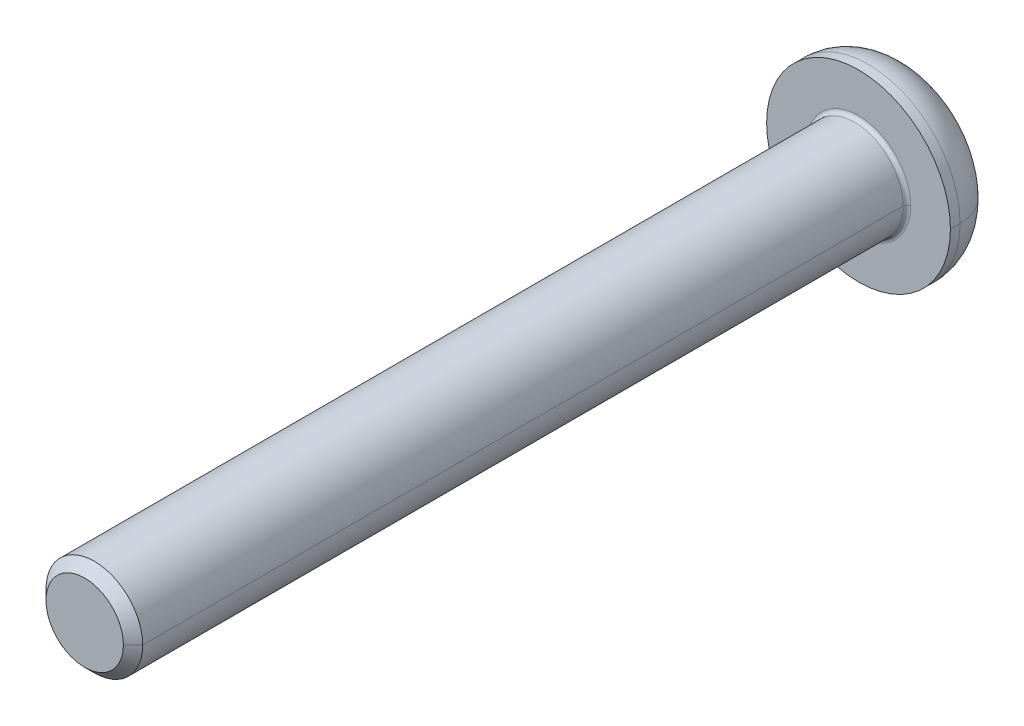
ISO-10303-21;
HEADER;
FILE_DESCRIPTION(('STEP AP214'),'2;1');
FILE_NAME('part.step','',(''),(''),'','','');
FILE_SCHEMA(('AUTOMOTIVE_DESIGN { 1 0 10303 214 1 1 1 1 }'));
ENDSEC;
DATA;
#1=APPLICATION_CONTEXT('core data for automotive mechanical design processes');
#2=APPLICATION_PROTOCOL_DEFINITION('international standard','automotive_design',2000,#1);
#3=PRODUCT_CONTEXT('',#1,'mechanical');
#4=PRODUCT('Part','Part','',(#3));
#5=PRODUCT_RELATED_PRODUCT_CATEGORY('part','',(#4));
#6=PRODUCT_DEFINITION_FORMATION('','',#4);
#7=PRODUCT_DEFINITION_CONTEXT('part definition',#1,'design');
#8=PRODUCT_DEFINITION('design','',#6,#7);
#9=PRODUCT_DEFINITION_SHAPE('','',#8);
#10=(LENGTH_UNIT() NAMED_UNIT(*) SI_UNIT(.MILLI.,.METRE.));
#11=(NAMED_UNIT(*) PLANE_ANGLE_UNIT() SI_UNIT($,.RADIAN.));
#12=(NAMED_UNIT(*) SI_UNIT($,.STERADIAN.) SOLID_ANGLE_UNIT());
#13=UNCERTAINTY_MEASURE_WITH_UNIT(LENGTH_MEASURE(1.E-05),#10,'distance_accuracy_value','');
#14=(GEOMETRIC_REPRESENTATION_CONTEXT(3) GLOBAL_UNCERTAINTY_ASSIGNED_CONTEXT((#13)) GLOBAL_UNIT_ASSIGNED_CONTEXT((#10,
#11,#12)) REPRESENTATION_CONTEXT('',''));
#15=CARTESIAN_POINT('',(0.,0.,0.));
#16=DIRECTION('',(0.,0.,1.));
#17=DIRECTION('',(1.,0.,0.));
#18=AXIS2_PLACEMENT_3D('',#15,#16,#17);
#19=CARTESIAN_POINT('',(0.,0.,0.2));
#20=DIRECTION('',(0.,0.,-1.));
#21=DIRECTION('',(-1.,0.,0.));
#22=AXIS2_PLACEMENT_3D('',#19,#20,#21);
#23=TOROIDAL_SURFACE('',#22,2.7,0.2);
#24=CARTESIAN_POINT('',(2.7,0.,0.2));
#25=DIRECTION('',(0.,1.,0.));
#26=DIRECTION('',(-1.,0.,0.));
#27=AXIS2_PLACEMENT_3D('',#24,#25,#26);
#28=CIRCLE('',#27,0.2);
#29=CARTESIAN_POINT('',(2.7,0.,0.));
#30=VERTEX_POINT('',#29);
#31=CARTESIAN_POINT('',(2.5,0.,0.2));
#32=VERTEX_POINT('',#31);
#33=EDGE_CURVE('E188',#30,#32,#28,.T.);
#34=ORIENTED_EDGE('',*,*,#33,.F.);
#35=CARTESIAN_POINT('',(0.,0.,0.));
#36=DIRECTION('',(0.,0.,-1.));
#37=DIRECTION('',(-1.,0.,0.));
#38=AXIS2_PLACEMENT_3D('',#35,#36,#37);
#39=CIRCLE('',#38,2.7);
#40=CARTESIAN_POINT('',(-2.7,0.,0.));
#41=VERTEX_POINT('',#40);
#42=EDGE_CURVE('E243',#41,#30,#39,.T.);
#43=ORIENTED_EDGE('',*,*,#42,.F.);
#44=CARTESIAN_POINT('',(-2.7,0.,0.2));
#45=DIRECTION('',(0.,-1.,0.));
#46=DIRECTION('',(0.,0.,-1.));
#47=AXIS2_PLACEMENT_3D('',#44,#45,#46);
#48=CIRCLE('',#47,0.2);
#49=CARTESIAN_POINT('',(-2.5,0.,0.2));
#50=VERTEX_POINT('',#49);
#51=EDGE_CURVE('E201',#41,#50,#48,.T.);
#52=ORIENTED_EDGE('',*,*,#51,.T.);
#53=CARTESIAN_POINT('',(0.,0.,0.2));
#54=DIRECTION('',(0.,0.,1.));
#55=DIRECTION('',(-1.,0.,0.));
#56=AXIS2_PLACEMENT_3D('',#53,#54,#55);
#57=CIRCLE('',#56,2.5);
#58=EDGE_CURVE('E197',#32,#50,#57,.T.);
#59=ORIENTED_EDGE('',*,*,#58,.F.);
#60=EDGE_LOOP('',(#34,#43,#52,#59));
#61=FACE_BOUND('',#60,.T.);
#62=ADVANCED_FACE('F18',(#61),#23,.F.);
#63=CARTESIAN_POINT('',(0.,0.,40.));
#64=DIRECTION('',(0.,0.,-1.));
#65=DIRECTION('',(-1.,0.,0.));
#66=AXIS2_PLACEMENT_3D('',#63,#64,#65);
#67=CONICAL_SURFACE('',#66,2.,0.785398163397446);
#68=DIRECTION('',(0.707106781186546,0.,-0.707106781186549));
#69=VECTOR('',#68,1.);
#70=CARTESIAN_POINT('',(2.,0.,40.));
#71=LINE('',#70,#69);
#72=CARTESIAN_POINT('',(2.,0.,40.));
#73=VERTEX_POINT('',#72);
#74=CARTESIAN_POINT('',(2.5,0.,39.5));
#75=VERTEX_POINT('',#74);
#76=EDGE_CURVE('E209',#73,#75,#71,.T.);
#77=ORIENTED_EDGE('',*,*,#76,.F.);
#78=CARTESIAN_POINT('',(0.,0.,40.));
#79=DIRECTION('',(0.,0.,1.));
#80=DIRECTION('',(1.,0.,0.));
#81=AXIS2_PLACEMENT_3D('',#78,#79,#80);
#82=CIRCLE('',#81,2.);
#83=CARTESIAN_POINT('',(-2.,0.,40.));
#84=VERTEX_POINT('',#83);
#85=EDGE_CURVE('E242',#84,#73,#82,.T.);
#86=ORIENTED_EDGE('',*,*,#85,.F.);
#87=DIRECTION('',(-0.707106781186546,0.,-0.707106781186549));
#88=VECTOR('',#87,1.);
#89=CARTESIAN_POINT('',(-2.,0.,40.));
#90=LINE('',#89,#88);
#91=CARTESIAN_POINT('',(-2.5,0.,39.5));
#92=VERTEX_POINT('',#91);
#93=EDGE_CURVE('E217',#84,#92,#90,.T.);
#94=ORIENTED_EDGE('',*,*,#93,.T.);
#95=CARTESIAN_POINT('',(0.,0.,39.5));
#96=DIRECTION('',(0.,0.,-1.));
#97=DIRECTION('',(1.,0.,0.));
#98=AXIS2_PLACEMENT_3D('',#95,#96,#97);
#99=CIRCLE('',#98,2.5);
#100=EDGE_CURVE('E239',#75,#92,#99,.T.);
#101=ORIENTED_EDGE('',*,*,#100,.F.);
#102=EDGE_LOOP('',(#77,#86,#94,#101));
#103=FACE_BOUND('',#102,.T.);
#104=ADVANCED_FACE('F345',(#103),#67,.T.);
#105=CARTESIAN_POINT('',(0.,0.,-0.5));
#106=DIRECTION('',(0.,0.,-1.));
#107=DIRECTION('',(-1.,0.,0.));
#108=AXIS2_PLACEMENT_3D('',#105,#106,#107);
#109=TOROIDAL_SURFACE('',#108,2.5,2.25);
#110=CARTESIAN_POINT('',(2.5,0.,-0.5));
#111=DIRECTION('',(0.,1.,0.));
#112=DIRECTION('',(-1.,0.,0.));
#113=AXIS2_PLACEMENT_3D('',#110,#111,#112);
#114=CIRCLE('',#113,2.25);
#115=CARTESIAN_POINT('',(4.75,0.,-0.5));
#116=VERTEX_POINT('',#115);
#117=CARTESIAN_POINT('',(2.5,0.,-2.75));
#118=VERTEX_POINT('',#117);
#119=EDGE_CURVE('E183',#116,#118,#114,.T.);
#120=ORIENTED_EDGE('',*,*,#119,.F.);
#121=CARTESIAN_POINT('',(0.,0.,-0.5));
#122=DIRECTION('',(0.,0.,1.));
#123=DIRECTION('',(-1.,0.,0.));
#124=AXIS2_PLACEMENT_3D('',#121,#122,#123);
#125=CIRCLE('',#124,4.75);
#126=CARTESIAN_POINT('',(-4.75,0.,-0.5));
#127=VERTEX_POINT('',#126);
#128=EDGE_CURVE('E158',#127,#116,#125,.T.);
#129=ORIENTED_EDGE('',*,*,#128,.F.);
#130=CARTESIAN_POINT('',(-2.5,0.,-0.5));
#131=DIRECTION('',(0.,-1.,0.));
#132=DIRECTION('',(0.,0.,-1.));
#133=AXIS2_PLACEMENT_3D('',#130,#131,#132);
#134=CIRCLE('',#133,2.25);
#135=CARTESIAN_POINT('',(-2.5,0.,-2.75));
#136=VERTEX_POINT('',#135);
#137=EDGE_CURVE('E170',#127,#136,#134,.T.);
#138=ORIENTED_EDGE('',*,*,#137,.T.);
#139=CARTESIAN_POINT('',(0.,0.,-2.75));
#140=DIRECTION('',(0.,0.,-1.));
#141=DIRECTION('',(-1.,0.,0.));
#142=AXIS2_PLACEMENT_3D('',#139,#140,#141);
#143=CIRCLE('',#142,2.5);
#144=EDGE_CURVE('E157',#118,#136,#143,.T.);
#145=ORIENTED_EDGE('',*,*,#144,.F.);
#146=EDGE_LOOP('',(#120,#129,#138,#145));
#147=FACE_BOUND('',#146,.T.);
#148=ADVANCED_FACE('F350',(#147),#109,.T.);
#149=CARTESIAN_POINT('',(0.,0.,-1.19));
#150=DIRECTION('',(0.,0.,-1.));
#151=DIRECTION('',(0.,-1.,0.));
#152=AXIS2_PLACEMENT_3D('',#149,#150,#151);
#153=PLANE('',#152);
#154=DIRECTION('',(-1.,0.,0.));
#155=VECTOR('',#154,1.);
#156=CARTESIAN_POINT('',(0.866025403784439,-1.5,-1.19));
#157=LINE('',#156,#155);
#158=CARTESIAN_POINT('',(0.866025403784439,-1.5,-1.19));
#159=VERTEX_POINT('',#158);
#160=CARTESIAN_POINT('',(-0.866025403784439,-1.5,-1.19));
#161=VERTEX_POINT('',#160);
#162=EDGE_CURVE('E279',#159,#161,#157,.T.);
#163=ORIENTED_EDGE('',*,*,#162,.T.);
#164=DIRECTION('',(-0.5,0.866025403784439,0.));
#165=VECTOR('',#164,1.);
#166=CARTESIAN_POINT('',(-0.866025403784439,-1.5,-1.19));
#167=LINE('',#166,#165);
#168=CARTESIAN_POINT('',(-1.73205080756888,0.,-1.19));
#169=VERTEX_POINT('',#168);
#170=EDGE_CURVE('E11',#161,#169,#167,.T.);
#171=ORIENTED_EDGE('',*,*,#170,.T.);
#172=DIRECTION('',(0.5,0.866025403784439,0.));
#173=VECTOR('',#172,1.);
#174=CARTESIAN_POINT('',(-1.73205080756888,0.,-1.19));
#175=LINE('',#174,#173);
#176=CARTESIAN_POINT('',(-0.86602540378444,1.5,-1.19));
#177=VERTEX_POINT('',#176);
#178=EDGE_CURVE('E46',#169,#177,#175,.T.);
#179=ORIENTED_EDGE('',*,*,#178,.T.);
#180=DIRECTION('',(1.,0.,0.));
#181=VECTOR('',#180,1.);
#182=CARTESIAN_POINT('',(-0.86602540378444,1.5,-1.19));
#183=LINE('',#182,#181);
#184=CARTESIAN_POINT('',(0.866025403784439,1.5,-1.19));
#185=VERTEX_POINT('',#184);
#186=EDGE_CURVE('E292',#177,#185,#183,.T.);
#187=ORIENTED_EDGE('',*,*,#186,.T.);
#188=DIRECTION('',(0.5,-0.866025403784439,0.));
#189=VECTOR('',#188,1.);
#190=CARTESIAN_POINT('',(0.866025403784439,1.5,-1.19));
#191=LINE('',#190,#189);
#192=CARTESIAN_POINT('',(1.73205080756888,0.,-1.19));
#193=VERTEX_POINT('',#192);
#194=EDGE_CURVE('E226',#185,#193,#191,.T.);
#195=ORIENTED_EDGE('',*,*,#194,.T.);
#196=DIRECTION('',(-0.5,-0.866025403784439,0.));
#197=VECTOR('',#196,1.);
#198=CARTESIAN_POINT('',(1.73205080756888,0.,-1.19));
#199=LINE('',#198,#197);
#200=EDGE_CURVE('E285',#193,#159,#199,.T.);
#201=ORIENTED_EDGE('',*,*,#200,.T.);
#202=EDGE_LOOP('',(#163,#171,#179,#187,#195,#201));
#203=FACE_BOUND('',#202,.T.);
#204=ADVANCED_FACE('F322',(#203),#153,.T.);
#205=CARTESIAN_POINT('',(-0.866025403784439,-1.5,-1.19));
#206=DIRECTION('',(-0.866025403784439,-0.5,0.));
#207=DIRECTION('',(-0.5,0.866025403784439,0.));
#208=AXIS2_PLACEMENT_3D('',#205,#206,#207);
#209=PLANE('',#208);
#210=DIRECTION('',(-0.5,0.866025403784439,0.));
#211=VECTOR('',#210,1.);
#212=CARTESIAN_POINT('',(-0.866025403784439,-1.5,-2.75));
#213=LINE('',#212,#211);
#214=CARTESIAN_POINT('',(-0.866025403784439,-1.5,-2.75));
#215=VERTEX_POINT('',#214);
#216=CARTESIAN_POINT('',(-1.73205080756888,0.,-2.75));
#217=VERTEX_POINT('',#216);
#218=EDGE_CURVE('E247',#215,#217,#213,.T.);
#219=ORIENTED_EDGE('',*,*,#218,.T.);
#220=DIRECTION('',(0.,0.,-1.));
#221=VECTOR('',#220,1.);
#222=CARTESIAN_POINT('',(-1.73205080756888,0.,-1.19));
#223=LINE('',#222,#221);
#224=EDGE_CURVE('E21',#169,#217,#223,.T.);
#225=ORIENTED_EDGE('',*,*,#224,.F.);
#226=ORIENTED_EDGE('',*,*,#170,.F.);
#227=DIRECTION('',(0.,0.,-1.));
#228=VECTOR('',#227,1.);
#229=CARTESIAN_POINT('',(-0.866025403784439,-1.5,-1.19));
#230=LINE('',#229,#228);
#231=EDGE_CURVE('E246',#161,#215,#230,.T.);
#232=ORIENTED_EDGE('',*,*,#231,.T.);
#233=EDGE_LOOP('',(#219,#225,#226,#232));
#234=FACE_BOUND('',#233,.T.);
#235=ADVANCED_FACE('F309',(#234),#209,.F.);
#236=CARTESIAN_POINT('',(-1.73205080756888,0.,-1.19));
#237=DIRECTION('',(-0.866025403784439,0.5,0.));
#238=DIRECTION('',(0.,0.,1.));
#239=AXIS2_PLACEMENT_3D('',#236,#237,#238);
#240=PLANE('',#239);
#241=DIRECTION('',(0.5,0.866025403784439,0.));
#242=VECTOR('',#241,1.);
#243=CARTESIAN_POINT('',(-1.73205080756888,0.,-2.75));
#244=LINE('',#243,#242);
#245=CARTESIAN_POINT('',(-0.86602540378444,1.5,-2.75));
#246=VERTEX_POINT('',#245);
#247=EDGE_CURVE('E270',#217,#246,#244,.T.);
#248=ORIENTED_EDGE('',*,*,#247,.T.);
#249=DIRECTION('',(0.,0.,-1.));
#250=VECTOR('',#249,1.);
#251=CARTESIAN_POINT('',(-0.86602540378444,1.5,-1.19));
#252=LINE('',#251,#250);
#253=EDGE_CURVE('E294',#177,#246,#252,.T.);
#254=ORIENTED_EDGE('',*,*,#253,.F.);
#255=ORIENTED_EDGE('',*,*,#178,.F.);
#256=ORIENTED_EDGE('',*,*,#224,.T.);
#257=EDGE_LOOP('',(#248,#254,#255,#256));
#258=FACE_BOUND('',#257,.T.);
#259=ADVANCED_FACE('F304',(#258),#240,.F.);
#260=CARTESIAN_POINT('',(-0.86602540378444,1.5,-1.19));
#261=DIRECTION('',(0.,1.,0.));
#262=DIRECTION('',(1.,0.,0.));
#263=AXIS2_PLACEMENT_3D('',#260,#261,#262);
#264=PLANE('',#263);
#265=DIRECTION('',(1.,0.,0.));
#266=VECTOR('',#265,1.);
#267=CARTESIAN_POINT('',(-0.86602540378444,1.5,-2.75));
#268=LINE('',#267,#266);
#269=CARTESIAN_POINT('',(0.866025403784439,1.5,-2.75));
#270=VERTEX_POINT('',#269);
#271=EDGE_CURVE('E266',#246,#270,#268,.T.);
#272=ORIENTED_EDGE('',*,*,#271,.T.);
#273=DIRECTION('',(0.,0.,-1.));
#274=VECTOR('',#273,1.);
#275=CARTESIAN_POINT('',(0.866025403784439,1.5,-1.19));
#276=LINE('',#275,#274);
#277=EDGE_CURVE('E229',#185,#270,#276,.T.);
#278=ORIENTED_EDGE('',*,*,#277,.F.);
#279=ORIENTED_EDGE('',*,*,#186,.F.);
#280=ORIENTED_EDGE('',*,*,#253,.T.);
#281=EDGE_LOOP('',(#272,#278,#279,#280));
#282=FACE_BOUND('',#281,.T.);
#283=ADVANCED_FACE('F319',(#282),#264,.F.);
#284=CARTESIAN_POINT('',(0.866025403784439,1.5,-1.19));
#285=DIRECTION('',(0.866025403784439,0.5,0.));
#286=DIRECTION('',(0.,0.,-1.));
#287=AXIS2_PLACEMENT_3D('',#284,#285,#286);
#288=PLANE('',#287);
#289=DIRECTION('',(0.5,-0.866025403784439,0.));
#290=VECTOR('',#289,1.);
#291=CARTESIAN_POINT('',(0.866025403784439,1.5,-2.75));
#292=LINE('',#291,#290);
#293=CARTESIAN_POINT('',(1.73205080756888,0.,-2.75));
#294=VERTEX_POINT('',#293);
#295=EDGE_CURVE('E262',#270,#294,#292,.T.);
#296=ORIENTED_EDGE('',*,*,#295,.T.);
#297=DIRECTION('',(0.,0.,-1.));
#298=VECTOR('',#297,1.);
#299=CARTESIAN_POINT('',(1.73205080756888,0.,-1.19));
#300=LINE('',#299,#298);
#301=EDGE_CURVE('E230',#193,#294,#300,.T.);
#302=ORIENTED_EDGE('',*,*,#301,.F.);
#303=ORIENTED_EDGE('',*,*,#194,.F.);
#304=ORIENTED_EDGE('',*,*,#277,.T.);
#305=EDGE_LOOP('',(#296,#302,#303,#304));
#306=FACE_BOUND('',#305,.T.);
#307=ADVANCED_FACE('F327',(#306),#288,.F.);
#308=CARTESIAN_POINT('',(1.73205080756888,0.,-1.19));
#309=DIRECTION('',(0.866025403784439,-0.5,0.));
#310=DIRECTION('',(0.,0.,-1.));
#311=AXIS2_PLACEMENT_3D('',#308,#309,#310);
#312=PLANE('',#311);
#313=DIRECTION('',(-0.5,-0.866025403784439,0.));
#314=VECTOR('',#313,1.);
#315=CARTESIAN_POINT('',(1.73205080756888,0.,-2.75));
#316=LINE('',#315,#314);
#317=CARTESIAN_POINT('',(0.866025403784439,-1.5,-2.75));
#318=VERTEX_POINT('',#317);
#319=EDGE_CURVE('E258',#294,#318,#316,.T.);
#320=ORIENTED_EDGE('',*,*,#319,.T.);
#321=DIRECTION('',(0.,0.,-1.));
#322=VECTOR('',#321,1.);
#323=CARTESIAN_POINT('',(0.866025403784439,-1.5,-1.19));
#324=LINE('',#323,#322);
#325=EDGE_CURVE('E282',#159,#318,#324,.T.);
#326=ORIENTED_EDGE('',*,*,#325,.F.);
#327=ORIENTED_EDGE('',*,*,#200,.F.);
#328=ORIENTED_EDGE('',*,*,#301,.T.);
#329=EDGE_LOOP('',(#320,#326,#327,#328));
#330=FACE_BOUND('',#329,.T.);
#331=ADVANCED_FACE('F329',(#330),#312,.F.);
#332=CARTESIAN_POINT('',(0.866025403784439,-1.5,-1.19));
#333=DIRECTION('',(0.,-1.,0.));
#334=DIRECTION('',(-1.,0.,0.));
#335=AXIS2_PLACEMENT_3D('',#332,#333,#334);
#336=PLANE('',#335);
#337=DIRECTION('',(-1.,0.,0.));
#338=VECTOR('',#337,1.);
#339=CARTESIAN_POINT('',(0.866025403784439,-1.5,-2.75));
#340=LINE('',#339,#338);
#341=EDGE_CURVE('E254',#318,#215,#340,.T.);
#342=ORIENTED_EDGE('',*,*,#341,.T.);
#343=ORIENTED_EDGE('',*,*,#231,.F.);
#344=ORIENTED_EDGE('',*,*,#162,.F.);
#345=ORIENTED_EDGE('',*,*,#325,.T.);
#346=EDGE_LOOP('',(#342,#343,#344,#345));
#347=FACE_BOUND('',#346,.T.);
#348=ADVANCED_FACE('F332',(#347),#336,.F.);
#349=CARTESIAN_POINT('',(0.,0.,0.));
#350=DIRECTION('',(0.,0.,-1.));
#351=DIRECTION('',(0.,-1.,0.));
#352=AXIS2_PLACEMENT_3D('',#349,#350,#351);
#353=PLANE('',#352);
#354=ORIENTED_EDGE('',*,*,#42,.T.);
#355=CARTESIAN_POINT('',(0.,0.,0.));
#356=DIRECTION('',(0.,0.,-1.));
#357=DIRECTION('',(-1.,0.,0.));
#358=AXIS2_PLACEMENT_3D('',#355,#356,#357);
#359=CIRCLE('',#358,2.7);
#360=EDGE_CURVE('E184',#30,#41,#359,.T.);
#361=ORIENTED_EDGE('',*,*,#360,.T.);
#362=EDGE_LOOP('',(#354,#361));
#363=FACE_BOUND('',#362,.T.);
#364=CARTESIAN_POINT('',(0.,0.,0.));
#365=DIRECTION('',(0.,0.,-1.));
#366=DIRECTION('',(-1.,0.,0.));
#367=AXIS2_PLACEMENT_3D('',#364,#365,#366);
#368=CIRCLE('',#367,4.75);
#369=CARTESIAN_POINT('',(4.75,0.,0.));
#370=VERTEX_POINT('',#369);
#371=CARTESIAN_POINT('',(-4.75,0.,0.));
#372=VERTEX_POINT('',#371);
#373=EDGE_CURVE('E146',#370,#372,#368,.T.);
#374=ORIENTED_EDGE('',*,*,#373,.F.);
#375=CARTESIAN_POINT('',(0.,0.,0.));
#376=DIRECTION('',(0.,0.,-1.));
#377=DIRECTION('',(-1.,0.,0.));
#378=AXIS2_PLACEMENT_3D('',#375,#376,#377);
#379=CIRCLE('',#378,4.75);
#380=EDGE_CURVE('E160',#372,#370,#379,.T.);
#381=ORIENTED_EDGE('',*,*,#380,.F.);
#382=EDGE_LOOP('',(#374,#381));
#383=FACE_BOUND('',#382,.T.);
#384=ADVANCED_FACE('F161',(#363,#383),#353,.F.);
#385=CARTESIAN_POINT('',(0.,0.,-2.75));
#386=DIRECTION('',(0.,0.,-1.));
#387=DIRECTION('',(0.,-1.,0.));
#388=AXIS2_PLACEMENT_3D('',#385,#386,#387);
#389=PLANE('',#388);
#390=ORIENTED_EDGE('',*,*,#341,.F.);
#391=ORIENTED_EDGE('',*,*,#319,.F.);
#392=ORIENTED_EDGE('',*,*,#295,.F.);
#393=ORIENTED_EDGE('',*,*,#271,.F.);
#394=ORIENTED_EDGE('',*,*,#247,.F.);
#395=ORIENTED_EDGE('',*,*,#218,.F.);
#396=EDGE_LOOP('',(#390,#391,#392,#393,#394,#395));
#397=FACE_BOUND('',#396,.T.);
#398=CARTESIAN_POINT('',(0.,0.,-2.75));
#399=DIRECTION('',(0.,0.,-1.));
#400=DIRECTION('',(-1.,0.,0.));
#401=AXIS2_PLACEMENT_3D('',#398,#399,#400);
#402=CIRCLE('',#401,2.5);
#403=EDGE_CURVE('E177',#136,#118,#402,.T.);
#404=ORIENTED_EDGE('',*,*,#403,.T.);
#405=ORIENTED_EDGE('',*,*,#144,.T.);
#406=EDGE_LOOP('',(#404,#405));
#407=FACE_BOUND('',#406,.T.);
#408=ADVANCED_FACE('F313',(#397,#407),#389,.T.);
#409=CARTESIAN_POINT('',(0.,0.,-2.75));
#410=DIRECTION('',(0.,0.,1.));
#411=DIRECTION('',(1.,0.,0.));
#412=AXIS2_PLACEMENT_3D('',#409,#410,#411);
#413=CYLINDRICAL_SURFACE('',#412,4.75);
#414=DIRECTION('',(0.,0.,1.));
#415=VECTOR('',#414,1.);
#416=CARTESIAN_POINT('',(-4.75,0.,-2.75));
#417=LINE('',#416,#415);
#418=EDGE_CURVE('E150',#127,#372,#417,.T.);
#419=ORIENTED_EDGE('',*,*,#418,.F.);
#420=ORIENTED_EDGE('',*,*,#128,.T.);
#421=DIRECTION('',(0.,0.,1.));
#422=VECTOR('',#421,1.);
#423=CARTESIAN_POINT('',(4.75,0.,-2.75));
#424=LINE('',#423,#422);
#425=EDGE_CURVE('E153',#116,#370,#424,.T.);
#426=ORIENTED_EDGE('',*,*,#425,.T.);
#427=ORIENTED_EDGE('',*,*,#373,.T.);
#428=EDGE_LOOP('',(#419,#420,#426,#427));
#429=FACE_BOUND('',#428,.T.);
#430=ADVANCED_FACE('F148',(#429),#413,.T.);
#431=CARTESIAN_POINT('',(0.,0.,40.));
#432=DIRECTION('',(0.,0.,1.));
#433=DIRECTION('',(1.,0.,0.));
#434=AXIS2_PLACEMENT_3D('',#431,#432,#433);
#435=PLANE('',#434);
#436=ORIENTED_EDGE('',*,*,#85,.T.);
#437=CARTESIAN_POINT('',(0.,0.,40.));
#438=DIRECTION('',(0.,0.,1.));
#439=DIRECTION('',(1.,0.,0.));
#440=AXIS2_PLACEMENT_3D('',#437,#438,#439);
#441=CIRCLE('',#440,2.);
#442=EDGE_CURVE('E205',#73,#84,#441,.T.);
#443=ORIENTED_EDGE('',*,*,#442,.T.);
#444=EDGE_LOOP('',(#436,#443));
#445=FACE_BOUND('',#444,.T.);
#446=ADVANCED_FACE('F372',(#445),#435,.T.);
#447=CARTESIAN_POINT('',(0.,0.,40.));
#448=DIRECTION('',(0.,0.,-1.));
#449=DIRECTION('',(-1.,0.,0.));
#450=AXIS2_PLACEMENT_3D('',#447,#448,#449);
#451=CYLINDRICAL_SURFACE('',#450,2.5);
#452=DIRECTION('',(0.,0.,-1.));
#453=VECTOR('',#452,1.);
#454=CARTESIAN_POINT('',(2.5,0.,40.));
#455=LINE('',#454,#453);
#456=EDGE_CURVE('E193',#75,#32,#455,.T.);
#457=ORIENTED_EDGE('',*,*,#456,.F.);
#458=ORIENTED_EDGE('',*,*,#100,.T.);
#459=DIRECTION('',(0.,0.,-1.));
#460=VECTOR('',#459,1.);
#461=CARTESIAN_POINT('',(-2.5,0.,40.));
#462=LINE('',#461,#460);
#463=EDGE_CURVE('E236',#92,#50,#462,.T.);
#464=ORIENTED_EDGE('',*,*,#463,.T.);
#465=CARTESIAN_POINT('',(0.,0.,0.2));
#466=DIRECTION('',(0.,0.,1.));
#467=DIRECTION('',(-1.,0.,0.));
#468=AXIS2_PLACEMENT_3D('',#465,#466,#467);
#469=CIRCLE('',#468,2.5);
#470=EDGE_CURVE('E192',#50,#32,#469,.T.);
#471=ORIENTED_EDGE('',*,*,#470,.T.);
#472=EDGE_LOOP('',(#457,#458,#464,#471));
#473=FACE_BOUND('',#472,.T.);
#474=ADVANCED_FACE('F361',(#473),#451,.T.);
#475=CARTESIAN_POINT('',(0.,0.,40.));
#476=DIRECTION('',(0.,0.,-1.));
#477=DIRECTION('',(-1.,0.,0.));
#478=AXIS2_PLACEMENT_3D('',#475,#476,#477);
#479=CYLINDRICAL_SURFACE('',#478,2.5);
#480=CARTESIAN_POINT('',(0.,0.,39.5));
#481=DIRECTION('',(0.,0.,-1.));
#482=DIRECTION('',(1.,0.,0.));
#483=AXIS2_PLACEMENT_3D('',#480,#481,#482);
#484=CIRCLE('',#483,2.5);
#485=EDGE_CURVE('E213',#92,#75,#484,.T.);
#486=ORIENTED_EDGE('',*,*,#485,.T.);
#487=ORIENTED_EDGE('',*,*,#456,.T.);
#488=ORIENTED_EDGE('',*,*,#58,.T.);
#489=ORIENTED_EDGE('',*,*,#463,.F.);
#490=EDGE_LOOP('',(#486,#487,#488,#489));
#491=FACE_BOUND('',#490,.T.);
#492=ADVANCED_FACE('F364',(#491),#479,.T.);
#493=CARTESIAN_POINT('',(0.,0.,-2.75));
#494=DIRECTION('',(0.,0.,1.));
#495=DIRECTION('',(1.,0.,0.));
#496=AXIS2_PLACEMENT_3D('',#493,#494,#495);
#497=CYLINDRICAL_SURFACE('',#496,4.75);
#498=CARTESIAN_POINT('',(0.,0.,-0.5));
#499=DIRECTION('',(0.,0.,1.));
#500=DIRECTION('',(-1.,0.,0.));
#501=AXIS2_PLACEMENT_3D('',#498,#499,#500);
#502=CIRCLE('',#501,4.75);
#503=EDGE_CURVE('E168',#116,#127,#502,.T.);
#504=ORIENTED_EDGE('',*,*,#503,.T.);
#505=ORIENTED_EDGE('',*,*,#418,.T.);
#506=ORIENTED_EDGE('',*,*,#380,.T.);
#507=ORIENTED_EDGE('',*,*,#425,.F.);
#508=EDGE_LOOP('',(#504,#505,#506,#507));
#509=FACE_BOUND('',#508,.T.);
#510=ADVANCED_FACE('F166',(#509),#497,.T.);
#511=CARTESIAN_POINT('',(0.,0.,-0.5));
#512=DIRECTION('',(0.,0.,-1.));
#513=DIRECTION('',(-1.,0.,0.));
#514=AXIS2_PLACEMENT_3D('',#511,#512,#513);
#515=TOROIDAL_SURFACE('',#514,2.5,2.25);
#516=ORIENTED_EDGE('',*,*,#503,.F.);
#517=ORIENTED_EDGE('',*,*,#119,.T.);
#518=ORIENTED_EDGE('',*,*,#403,.F.);
#519=ORIENTED_EDGE('',*,*,#137,.F.);
#520=EDGE_LOOP('',(#516,#517,#518,#519));
#521=FACE_BOUND('',#520,.T.);
#522=ADVANCED_FACE('F402',(#521),#515,.T.);
#523=CARTESIAN_POINT('',(0.,0.,40.));
#524=DIRECTION('',(0.,0.,-1.));
#525=DIRECTION('',(-1.,0.,0.));
#526=AXIS2_PLACEMENT_3D('',#523,#524,#525);
#527=CONICAL_SURFACE('',#526,2.,0.785398163397446);
#528=ORIENTED_EDGE('',*,*,#442,.F.);
#529=ORIENTED_EDGE('',*,*,#76,.T.);
#530=ORIENTED_EDGE('',*,*,#485,.F.);
#531=ORIENTED_EDGE('',*,*,#93,.F.);
#532=EDGE_LOOP('',(#528,#529,#530,#531));
#533=FACE_BOUND('',#532,.T.);
#534=ADVANCED_FACE('F370',(#533),#527,.T.);
#535=CARTESIAN_POINT('',(0.,0.,0.2));
#536=DIRECTION('',(0.,0.,-1.));
#537=DIRECTION('',(-1.,0.,0.));
#538=AXIS2_PLACEMENT_3D('',#535,#536,#537);
#539=TOROIDAL_SURFACE('',#538,2.7,0.2);
#540=ORIENTED_EDGE('',*,*,#360,.F.);
#541=ORIENTED_EDGE('',*,*,#33,.T.);
#542=ORIENTED_EDGE('',*,*,#470,.F.);
#543=ORIENTED_EDGE('',*,*,#51,.F.);
#544=EDGE_LOOP('',(#540,#541,#542,#543));
#545=FACE_BOUND('',#544,.T.);
#546=ADVANCED_FACE('F358',(#545),#539,.F.);
#547=CLOSED_SHELL('',(#62,#104,#148,#204,#235,#259,#283,#307,#331,#348,#384,#408,#430,#446,#474,
#492,#510,#522,#534,#546));
#548=MANIFOLD_SOLID_BREP('B1',#547);
#549=ADVANCED_BREP_SHAPE_REPRESENTATION('',(#18,#548),#14);
#550=SHAPE_DEFINITION_REPRESENTATION(#9,#549);
ENDSEC;
END-ISO-10303-21;
